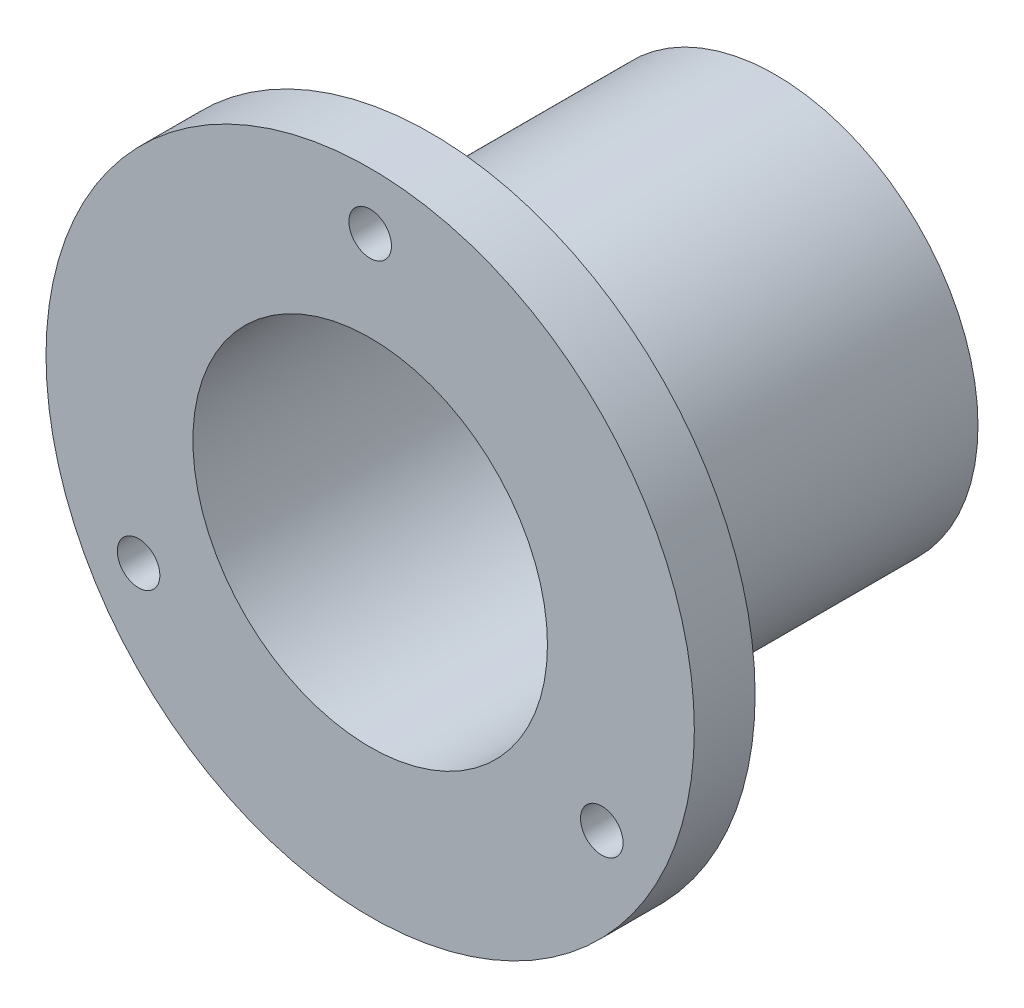
ISO-10303-21;
HEADER;
FILE_DESCRIPTION(('STEP AP214'),'2;1');
FILE_NAME('part.step','',(''),(''),'','','');
FILE_SCHEMA(('AUTOMOTIVE_DESIGN { 1 0 10303 214 1 1 1 1 }'));
ENDSEC;
DATA;
#1=APPLICATION_CONTEXT('core data for automotive mechanical design processes');
#2=APPLICATION_PROTOCOL_DEFINITION('international standard','automotive_design',2000,#1);
#3=PRODUCT_CONTEXT('',#1,'mechanical');
#4=PRODUCT('Part','Part','',(#3));
#5=PRODUCT_RELATED_PRODUCT_CATEGORY('part','',(#4));
#6=PRODUCT_DEFINITION_FORMATION('','',#4);
#7=PRODUCT_DEFINITION_CONTEXT('part definition',#1,'design');
#8=PRODUCT_DEFINITION('design','',#6,#7);
#9=PRODUCT_DEFINITION_SHAPE('','',#8);
#10=(LENGTH_UNIT() NAMED_UNIT(*) SI_UNIT(.MILLI.,.METRE.));
#11=(NAMED_UNIT(*) PLANE_ANGLE_UNIT() SI_UNIT($,.RADIAN.));
#12=(NAMED_UNIT(*) SI_UNIT($,.STERADIAN.) SOLID_ANGLE_UNIT());
#13=UNCERTAINTY_MEASURE_WITH_UNIT(LENGTH_MEASURE(1.E-05),#10,'distance_accuracy_value','');
#14=(GEOMETRIC_REPRESENTATION_CONTEXT(3) GLOBAL_UNCERTAINTY_ASSIGNED_CONTEXT((#13)) GLOBAL_UNIT_ASSIGNED_CONTEXT((#10,
#11,#12)) REPRESENTATION_CONTEXT('',''));
#15=CARTESIAN_POINT('',(0.,0.,0.));
#16=DIRECTION('',(0.,0.,1.));
#17=DIRECTION('',(1.,0.,0.));
#18=AXIS2_PLACEMENT_3D('',#15,#16,#17);
#19=CARTESIAN_POINT('',(0.,0.,20.));
#20=DIRECTION('',(0.,0.,-1.));
#21=DIRECTION('',(-1.,0.,0.));
#22=AXIS2_PLACEMENT_3D('',#19,#20,#21);
#23=CYLINDRICAL_SURFACE('',#22,20.);
#24=CARTESIAN_POINT('',(0.,0.,13.));
#25=DIRECTION('',(0.,0.,1.));
#26=DIRECTION('',(1.,0.,0.));
#27=AXIS2_PLACEMENT_3D('',#24,#25,#26);
#28=CIRCLE('',#27,20.);
#29=CARTESIAN_POINT('',(20.,0.,13.));
#30=VERTEX_POINT('',#29);
#31=EDGE_CURVE('E10',#30,#30,#28,.F.);
#32=ORIENTED_EDGE('',*,*,#31,.T.);
#33=EDGE_LOOP('',(#32));
#34=FACE_BOUND('',#33,.T.);
#35=CARTESIAN_POINT('',(0.,0.,-20.));
#36=DIRECTION('',(0.,0.,1.));
#37=DIRECTION('',(1.,0.,0.));
#38=AXIS2_PLACEMENT_3D('',#35,#36,#37);
#39=CIRCLE('',#38,20.);
#40=CARTESIAN_POINT('',(20.,0.,-20.));
#41=VERTEX_POINT('',#40);
#42=EDGE_CURVE('E61',#41,#41,#39,.T.);
#43=ORIENTED_EDGE('',*,*,#42,.T.);
#44=EDGE_LOOP('',(#43));
#45=FACE_BOUND('',#44,.T.);
#46=ADVANCED_FACE('F41',(#34,#45),#23,.T.);
#47=CARTESIAN_POINT('',(0.,0.,20.));
#48=DIRECTION('',(0.,0.,1.));
#49=DIRECTION('',(1.,0.,0.));
#50=AXIS2_PLACEMENT_3D('',#47,#48,#49);
#51=PLANE('',#50);
#52=CARTESIAN_POINT('',(0.,0.,20.));
#53=DIRECTION('',(0.,0.,1.));
#54=DIRECTION('',(1.,0.,0.));
#55=AXIS2_PLACEMENT_3D('',#52,#53,#54);
#56=CIRCLE('',#55,17.5);
#57=CARTESIAN_POINT('',(17.5,0.,20.));
#58=VERTEX_POINT('',#57);
#59=EDGE_CURVE('E64',#58,#58,#56,.T.);
#60=ORIENTED_EDGE('',*,*,#59,.F.);
#61=EDGE_LOOP('',(#60));
#62=FACE_BOUND('',#61,.T.);
#63=CARTESIAN_POINT('',(-22.8630706599091,-13.2000000000001,20.));
#64=DIRECTION('',(0.,0.,-1.));
#65=DIRECTION('',(0.500000000000004,-0.866025403784436,0.));
#66=AXIS2_PLACEMENT_3D('',#63,#64,#65);
#67=CIRCLE('',#66,2.1);
#68=CARTESIAN_POINT('',(-21.8130706599091,-15.0186533479474,20.));
#69=VERTEX_POINT('',#68);
#70=EDGE_CURVE('E83',#69,#69,#67,.T.);
#71=ORIENTED_EDGE('',*,*,#70,.T.);
#72=EDGE_LOOP('',(#71));
#73=FACE_BOUND('',#72,.T.);
#74=CARTESIAN_POINT('',(22.8630706599093,-13.1999999999998,20.));
#75=DIRECTION('',(0.,0.,-1.));
#76=DIRECTION('',(0.499999999999992,0.866025403784443,0.));
#77=AXIS2_PLACEMENT_3D('',#74,#75,#76);
#78=CIRCLE('',#77,2.1);
#79=CARTESIAN_POINT('',(23.9130706599093,-11.3813466520525,20.));
#80=VERTEX_POINT('',#79);
#81=EDGE_CURVE('E84',#80,#80,#78,.T.);
#82=ORIENTED_EDGE('',*,*,#81,.T.);
#83=EDGE_LOOP('',(#82));
#84=FACE_BOUND('',#83,.T.);
#85=CARTESIAN_POINT('',(0.,26.4,20.));
#86=DIRECTION('',(0.,0.,-1.));
#87=DIRECTION('',(-1.,0.,0.));
#88=AXIS2_PLACEMENT_3D('',#85,#86,#87);
#89=CIRCLE('',#88,2.1);
#90=CARTESIAN_POINT('',(-2.1,26.4,20.));
#91=VERTEX_POINT('',#90);
#92=EDGE_CURVE('E71',#91,#91,#89,.T.);
#93=ORIENTED_EDGE('',*,*,#92,.T.);
#94=EDGE_LOOP('',(#93));
#95=FACE_BOUND('',#94,.T.);
#96=CARTESIAN_POINT('',(0.,0.,20.));
#97=DIRECTION('',(0.,0.,1.));
#98=DIRECTION('',(1.,0.,0.));
#99=AXIS2_PLACEMENT_3D('',#96,#97,#98);
#100=CIRCLE('',#99,32.);
#101=CARTESIAN_POINT('',(32.,0.,20.));
#102=VERTEX_POINT('',#101);
#103=EDGE_CURVE('E68',#102,#102,#100,.T.);
#104=ORIENTED_EDGE('',*,*,#103,.T.);
#105=EDGE_LOOP('',(#104));
#106=FACE_BOUND('',#105,.T.);
#107=ADVANCED_FACE('F92',(#62,#73,#84,#95,#106),#51,.T.);
#108=CARTESIAN_POINT('',(0.,0.,-20.));
#109=DIRECTION('',(0.,0.,1.));
#110=DIRECTION('',(1.,0.,0.));
#111=AXIS2_PLACEMENT_3D('',#108,#109,#110);
#112=PLANE('',#111);
#113=CARTESIAN_POINT('',(0.,0.,-20.));
#114=DIRECTION('',(0.,0.,1.));
#115=DIRECTION('',(1.,0.,0.));
#116=AXIS2_PLACEMENT_3D('',#113,#114,#115);
#117=CIRCLE('',#116,18.5);
#118=CARTESIAN_POINT('',(18.5,0.,-20.));
#119=VERTEX_POINT('',#118);
#120=EDGE_CURVE('E56',#119,#119,#117,.T.);
#121=ORIENTED_EDGE('',*,*,#120,.T.);
#122=EDGE_LOOP('',(#121));
#123=FACE_BOUND('',#122,.T.);
#124=ORIENTED_EDGE('',*,*,#42,.F.);
#125=EDGE_LOOP('',(#124));
#126=FACE_BOUND('',#125,.T.);
#127=ADVANCED_FACE('F121',(#123,#126),#112,.F.);
#128=CARTESIAN_POINT('',(0.,0.,20.));
#129=DIRECTION('',(0.,0.,-1.));
#130=DIRECTION('',(-1.,0.,0.));
#131=AXIS2_PLACEMENT_3D('',#128,#129,#130);
#132=CYLINDRICAL_SURFACE('',#131,17.5);
#133=CARTESIAN_POINT('',(0.,0.,-19.));
#134=DIRECTION('',(0.,0.,1.));
#135=DIRECTION('',(1.,0.,0.));
#136=AXIS2_PLACEMENT_3D('',#133,#134,#135);
#137=CIRCLE('',#136,17.5);
#138=CARTESIAN_POINT('',(17.5,0.,-19.));
#139=VERTEX_POINT('',#138);
#140=EDGE_CURVE('E52',#139,#139,#137,.F.);
#141=ORIENTED_EDGE('',*,*,#140,.T.);
#142=EDGE_LOOP('',(#141));
#143=FACE_BOUND('',#142,.T.);
#144=ORIENTED_EDGE('',*,*,#59,.T.);
#145=EDGE_LOOP('',(#144));
#146=FACE_BOUND('',#145,.T.);
#147=ADVANCED_FACE('F128',(#143,#146),#132,.F.);
#148=CARTESIAN_POINT('',(0.,0.,-20.));
#149=DIRECTION('',(0.,0.,-1.));
#150=DIRECTION('',(-1.,0.,0.));
#151=AXIS2_PLACEMENT_3D('',#148,#149,#150);
#152=CONICAL_SURFACE('',#151,18.5,0.785398163397443);
#153=ORIENTED_EDGE('',*,*,#140,.F.);
#154=EDGE_LOOP('',(#153));
#155=FACE_BOUND('',#154,.T.);
#156=ORIENTED_EDGE('',*,*,#120,.F.);
#157=EDGE_LOOP('',(#156));
#158=FACE_BOUND('',#157,.T.);
#159=ADVANCED_FACE('F116',(#155,#158),#152,.F.);
#160=CARTESIAN_POINT('',(0.,0.,14.));
#161=DIRECTION('',(0.,0.,1.));
#162=DIRECTION('',(1.,0.,0.));
#163=AXIS2_PLACEMENT_3D('',#160,#161,#162);
#164=CYLINDRICAL_SURFACE('',#163,32.);
#165=CARTESIAN_POINT('',(0.,0.,14.));
#166=DIRECTION('',(0.,0.,1.));
#167=DIRECTION('',(1.,0.,0.));
#168=AXIS2_PLACEMENT_3D('',#165,#166,#167);
#169=CIRCLE('',#168,32.);
#170=CARTESIAN_POINT('',(32.,0.,14.));
#171=VERTEX_POINT('',#170);
#172=EDGE_CURVE('E67',#171,#171,#169,.T.);
#173=ORIENTED_EDGE('',*,*,#172,.T.);
#174=EDGE_LOOP('',(#173));
#175=FACE_BOUND('',#174,.T.);
#176=ORIENTED_EDGE('',*,*,#103,.F.);
#177=EDGE_LOOP('',(#176));
#178=FACE_BOUND('',#177,.T.);
#179=ADVANCED_FACE('F106',(#175,#178),#164,.T.);
#180=CARTESIAN_POINT('',(0.,0.,14.));
#181=DIRECTION('',(0.,0.,1.));
#182=DIRECTION('',(1.,0.,0.));
#183=AXIS2_PLACEMENT_3D('',#180,#181,#182);
#184=PLANE('',#183);
#185=CARTESIAN_POINT('',(0.,0.,14.));
#186=DIRECTION('',(0.,0.,1.));
#187=DIRECTION('',(1.,0.,0.));
#188=AXIS2_PLACEMENT_3D('',#185,#186,#187);
#189=CIRCLE('',#188,21.);
#190=CARTESIAN_POINT('',(21.,0.,14.));
#191=VERTEX_POINT('',#190);
#192=EDGE_CURVE('E48',#191,#191,#189,.T.);
#193=ORIENTED_EDGE('',*,*,#192,.T.);
#194=EDGE_LOOP('',(#193));
#195=FACE_BOUND('',#194,.T.);
#196=CARTESIAN_POINT('',(-22.8630706599091,-13.2000000000001,14.));
#197=DIRECTION('',(0.,0.,-1.));
#198=DIRECTION('',(0.500000000000004,-0.866025403784436,0.));
#199=AXIS2_PLACEMENT_3D('',#196,#197,#198);
#200=CIRCLE('',#199,2.1);
#201=CARTESIAN_POINT('',(-21.8130706599091,-15.0186533479474,14.));
#202=VERTEX_POINT('',#201);
#203=EDGE_CURVE('E79',#202,#202,#200,.T.);
#204=ORIENTED_EDGE('',*,*,#203,.F.);
#205=EDGE_LOOP('',(#204));
#206=FACE_BOUND('',#205,.T.);
#207=CARTESIAN_POINT('',(22.8630706599093,-13.1999999999998,14.));
#208=DIRECTION('',(0.,0.,-1.));
#209=DIRECTION('',(0.499999999999992,0.866025403784443,0.));
#210=AXIS2_PLACEMENT_3D('',#207,#208,#209);
#211=CIRCLE('',#210,2.1);
#212=CARTESIAN_POINT('',(23.9130706599093,-11.3813466520525,14.));
#213=VERTEX_POINT('',#212);
#214=EDGE_CURVE('E80',#213,#213,#211,.T.);
#215=ORIENTED_EDGE('',*,*,#214,.F.);
#216=EDGE_LOOP('',(#215));
#217=FACE_BOUND('',#216,.T.);
#218=CARTESIAN_POINT('',(0.,26.4,14.));
#219=DIRECTION('',(0.,0.,-1.));
#220=DIRECTION('',(-1.,0.,0.));
#221=AXIS2_PLACEMENT_3D('',#218,#219,#220);
#222=CIRCLE('',#221,2.1);
#223=CARTESIAN_POINT('',(-2.1,26.4,14.));
#224=VERTEX_POINT('',#223);
#225=EDGE_CURVE('E76',#224,#224,#222,.T.);
#226=ORIENTED_EDGE('',*,*,#225,.F.);
#227=EDGE_LOOP('',(#226));
#228=FACE_BOUND('',#227,.T.);
#229=ORIENTED_EDGE('',*,*,#172,.F.);
#230=EDGE_LOOP('',(#229));
#231=FACE_BOUND('',#230,.T.);
#232=ADVANCED_FACE('F102',(#195,#206,#217,#228,#231),#184,.F.);
#233=CARTESIAN_POINT('',(0.,26.4,14.));
#234=DIRECTION('',(0.,0.,-1.));
#235=DIRECTION('',(-1.,0.,0.));
#236=AXIS2_PLACEMENT_3D('',#233,#234,#235);
#237=CYLINDRICAL_SURFACE('',#236,2.1);
#238=ORIENTED_EDGE('',*,*,#92,.F.);
#239=EDGE_LOOP('',(#238));
#240=FACE_BOUND('',#239,.T.);
#241=ORIENTED_EDGE('',*,*,#225,.T.);
#242=EDGE_LOOP('',(#241));
#243=FACE_BOUND('',#242,.T.);
#244=ADVANCED_FACE('F105',(#240,#243),#237,.F.);
#245=CARTESIAN_POINT('',(22.8630706599093,-13.1999999999998,14.));
#246=DIRECTION('',(0.,0.,-1.));
#247=DIRECTION('',(0.499999999999992,0.866025403784443,0.));
#248=AXIS2_PLACEMENT_3D('',#245,#246,#247);
#249=CYLINDRICAL_SURFACE('',#248,2.1);
#250=ORIENTED_EDGE('',*,*,#81,.F.);
#251=EDGE_LOOP('',(#250));
#252=FACE_BOUND('',#251,.T.);
#253=ORIENTED_EDGE('',*,*,#214,.T.);
#254=EDGE_LOOP('',(#253));
#255=FACE_BOUND('',#254,.T.);
#256=ADVANCED_FACE('F98',(#252,#255),#249,.F.);
#257=CARTESIAN_POINT('',(-22.8630706599091,-13.2000000000001,14.));
#258=DIRECTION('',(0.,0.,-1.));
#259=DIRECTION('',(0.500000000000004,-0.866025403784436,0.));
#260=AXIS2_PLACEMENT_3D('',#257,#258,#259);
#261=CYLINDRICAL_SURFACE('',#260,2.1);
#262=ORIENTED_EDGE('',*,*,#70,.F.);
#263=EDGE_LOOP('',(#262));
#264=FACE_BOUND('',#263,.T.);
#265=ORIENTED_EDGE('',*,*,#203,.T.);
#266=EDGE_LOOP('',(#265));
#267=FACE_BOUND('',#266,.T.);
#268=ADVANCED_FACE('F95',(#264,#267),#261,.F.);
#269=CARTESIAN_POINT('',(0.,0.,13.));
#270=DIRECTION('',(0.,0.,1.));
#271=DIRECTION('',(1.,0.,0.));
#272=AXIS2_PLACEMENT_3D('',#269,#270,#271);
#273=TOROIDAL_SURFACE('',#272,21.,1.);
#274=ORIENTED_EDGE('',*,*,#31,.F.);
#275=EDGE_LOOP('',(#274));
#276=FACE_BOUND('',#275,.T.);
#277=ORIENTED_EDGE('',*,*,#192,.F.);
#278=EDGE_LOOP('',(#277));
#279=FACE_BOUND('',#278,.T.);
#280=ADVANCED_FACE('F43',(#276,#279),#273,.F.);
#281=CLOSED_SHELL('',(#46,#107,#127,#147,#159,#179,#232,#244,#256,#268,#280));
#282=MANIFOLD_SOLID_BREP('B2',#281);
#283=ADVANCED_BREP_SHAPE_REPRESENTATION('',(#18,#282),#14);
#284=SHAPE_DEFINITION_REPRESENTATION(#9,#283);
ENDSEC;
END-ISO-10303-21;
